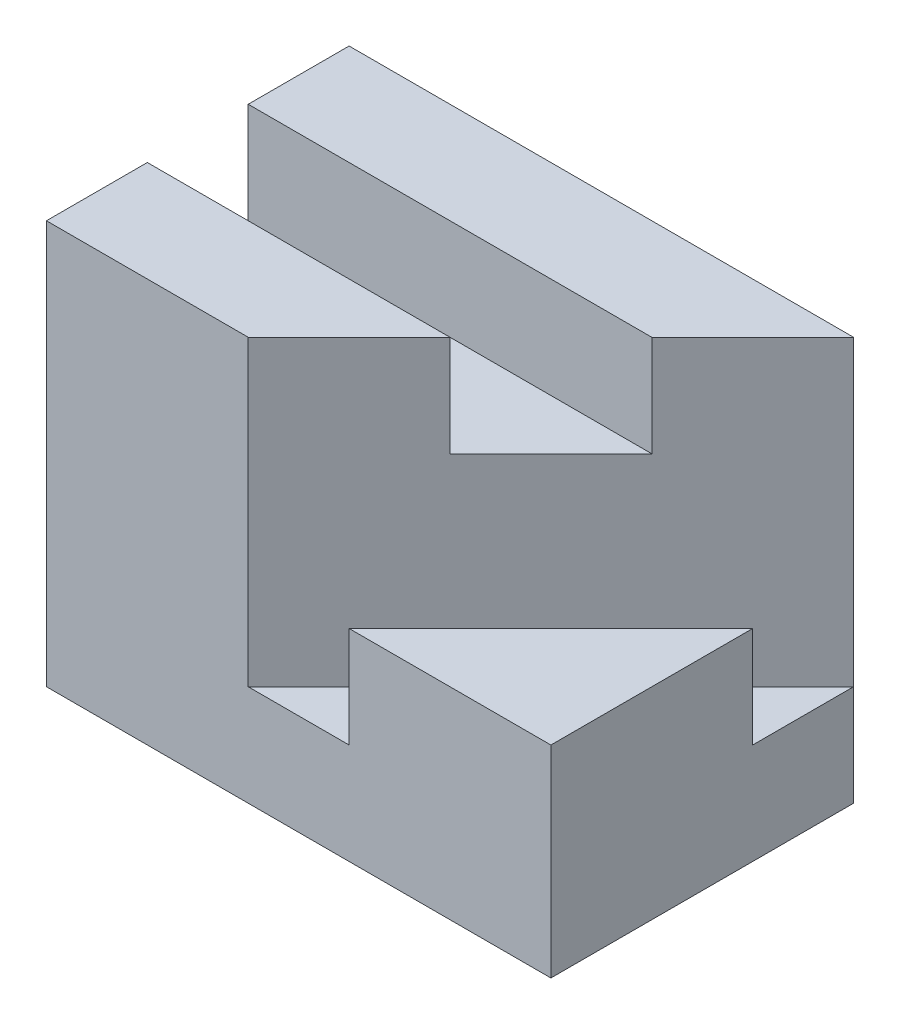
ISO-10303-21;
HEADER;
FILE_DESCRIPTION(('STEP AP214'),'2;1');
FILE_NAME('part.step','',(''),(''),'','','');
FILE_SCHEMA(('AUTOMOTIVE_DESIGN { 1 0 10303 214 1 1 1 1 }'));
ENDSEC;
DATA;
#1=APPLICATION_CONTEXT('core data for automotive mechanical design processes');
#2=APPLICATION_PROTOCOL_DEFINITION('international standard','automotive_design',2000,#1);
#3=PRODUCT_CONTEXT('',#1,'mechanical');
#4=PRODUCT('Part','Part','',(#3));
#5=PRODUCT_RELATED_PRODUCT_CATEGORY('part','',(#4));
#6=PRODUCT_DEFINITION_FORMATION('','',#4);
#7=PRODUCT_DEFINITION_CONTEXT('part definition',#1,'design');
#8=PRODUCT_DEFINITION('design','',#6,#7);
#9=PRODUCT_DEFINITION_SHAPE('','',#8);
#10=(LENGTH_UNIT() NAMED_UNIT(*) SI_UNIT(.MILLI.,.METRE.));
#11=(NAMED_UNIT(*) PLANE_ANGLE_UNIT() SI_UNIT($,.RADIAN.));
#12=(NAMED_UNIT(*) SI_UNIT($,.STERADIAN.) SOLID_ANGLE_UNIT());
#13=UNCERTAINTY_MEASURE_WITH_UNIT(LENGTH_MEASURE(1.E-05),#10,'distance_accuracy_value','');
#14=(GEOMETRIC_REPRESENTATION_CONTEXT(3) GLOBAL_UNCERTAINTY_ASSIGNED_CONTEXT((#13)) GLOBAL_UNIT_ASSIGNED_CONTEXT((#10,
#11,#12)) REPRESENTATION_CONTEXT('',''));
#15=CARTESIAN_POINT('',(0.,0.,0.));
#16=DIRECTION('',(0.,0.,1.));
#17=DIRECTION('',(1.,0.,0.));
#18=AXIS2_PLACEMENT_3D('',#15,#16,#17);
#19=CARTESIAN_POINT('',(0.,40.,0.));
#20=DIRECTION('',(0.,-1.,0.));
#21=DIRECTION('',(0.,0.,-1.));
#22=AXIS2_PLACEMENT_3D('',#19,#20,#21);
#23=PLANE('',#22);
#24=DIRECTION('',(1.,0.,0.));
#25=VECTOR('',#24,1.);
#26=CARTESIAN_POINT('',(-25.,40.,15.));
#27=LINE('',#26,#25);
#28=CARTESIAN_POINT('',(-25.,40.,15.));
#29=VERTEX_POINT('',#28);
#30=CARTESIAN_POINT('',(-4.99999999999999,40.,15.));
#31=VERTEX_POINT('',#30);
#32=EDGE_CURVE('E86',#29,#31,#27,.T.);
#33=ORIENTED_EDGE('',*,*,#32,.T.);
#34=DIRECTION('',(-0.707106781186547,0.,0.707106781186547));
#35=VECTOR('',#34,1.);
#36=CARTESIAN_POINT('',(25.,40.,-15.));
#37=LINE('',#36,#35);
#38=CARTESIAN_POINT('',(5.00000000000001,40.,5.));
#39=VERTEX_POINT('',#38);
#40=EDGE_CURVE('E182',#39,#31,#37,.T.);
#41=ORIENTED_EDGE('',*,*,#40,.F.);
#42=DIRECTION('',(1.,0.,0.));
#43=VECTOR('',#42,1.);
#44=CARTESIAN_POINT('',(-25.,40.,5.));
#45=LINE('',#44,#43);
#46=CARTESIAN_POINT('',(-25.,40.,5.));
#47=VERTEX_POINT('',#46);
#48=EDGE_CURVE('E98',#47,#39,#45,.T.);
#49=ORIENTED_EDGE('',*,*,#48,.F.);
#50=DIRECTION('',(0.,0.,1.));
#51=VECTOR('',#50,1.);
#52=CARTESIAN_POINT('',(-25.,40.,15.));
#53=LINE('',#52,#51);
#54=EDGE_CURVE('E49',#47,#29,#53,.T.);
#55=ORIENTED_EDGE('',*,*,#54,.T.);
#56=EDGE_LOOP('',(#33,#41,#49,#55));
#57=FACE_BOUND('',#56,.T.);
#58=ADVANCED_FACE('F32',(#57),#23,.F.);
#59=CARTESIAN_POINT('',(25.,40.,15.));
#60=DIRECTION('',(-1.,0.,0.));
#61=DIRECTION('',(0.,0.,1.));
#62=AXIS2_PLACEMENT_3D('',#59,#60,#61);
#63=PLANE('',#62);
#64=DIRECTION('',(0.,0.,-1.));
#65=VECTOR('',#64,1.);
#66=CARTESIAN_POINT('',(25.,10.,-15.));
#67=LINE('',#66,#65);
#68=CARTESIAN_POINT('',(25.,10.,-5.));
#69=VERTEX_POINT('',#68);
#70=CARTESIAN_POINT('',(25.,10.,-15.));
#71=VERTEX_POINT('',#70);
#72=EDGE_CURVE('E120',#69,#71,#67,.T.);
#73=ORIENTED_EDGE('',*,*,#72,.F.);
#74=DIRECTION('',(0.,1.,0.));
#75=VECTOR('',#74,1.);
#76=CARTESIAN_POINT('',(25.,10.,-5.));
#77=LINE('',#76,#75);
#78=CARTESIAN_POINT('',(25.,20.,-5.));
#79=VERTEX_POINT('',#78);
#80=EDGE_CURVE('E208',#69,#79,#77,.T.);
#81=ORIENTED_EDGE('',*,*,#80,.T.);
#82=DIRECTION('',(0.,0.,-1.));
#83=VECTOR('',#82,1.);
#84=CARTESIAN_POINT('',(25.,20.,15.));
#85=LINE('',#84,#83);
#86=CARTESIAN_POINT('',(25.,20.,15.));
#87=VERTEX_POINT('',#86);
#88=EDGE_CURVE('E82',#87,#79,#85,.T.);
#89=ORIENTED_EDGE('',*,*,#88,.F.);
#90=DIRECTION('',(0.,-1.,0.));
#91=VECTOR('',#90,1.);
#92=CARTESIAN_POINT('',(25.,40.,15.));
#93=LINE('',#92,#91);
#94=CARTESIAN_POINT('',(25.,0.,15.));
#95=VERTEX_POINT('',#94);
#96=EDGE_CURVE('E73',#87,#95,#93,.T.);
#97=ORIENTED_EDGE('',*,*,#96,.T.);
#98=DIRECTION('',(0.,0.,-1.));
#99=VECTOR('',#98,1.);
#100=CARTESIAN_POINT('',(25.,0.,15.));
#101=LINE('',#100,#99);
#102=CARTESIAN_POINT('',(25.,0.,-15.));
#103=VERTEX_POINT('',#102);
#104=EDGE_CURVE('E78',#95,#103,#101,.T.);
#105=ORIENTED_EDGE('',*,*,#104,.T.);
#106=DIRECTION('',(0.,-1.,0.));
#107=VECTOR('',#106,1.);
#108=CARTESIAN_POINT('',(25.,40.,-15.));
#109=LINE('',#108,#107);
#110=EDGE_CURVE('E110',#71,#103,#109,.T.);
#111=ORIENTED_EDGE('',*,*,#110,.F.);
#112=EDGE_LOOP('',(#73,#81,#89,#97,#105,#111));
#113=FACE_BOUND('',#112,.T.);
#114=ADVANCED_FACE('F34',(#113),#63,.F.);
#115=CARTESIAN_POINT('',(-25.,40.,-15.));
#116=DIRECTION('',(0.,0.,1.));
#117=DIRECTION('',(1.,0.,0.));
#118=AXIS2_PLACEMENT_3D('',#115,#116,#117);
#119=PLANE('',#118);
#120=DIRECTION('',(-1.,0.,0.));
#121=VECTOR('',#120,1.);
#122=CARTESIAN_POINT('',(-25.,0.,-15.));
#123=LINE('',#122,#121);
#124=CARTESIAN_POINT('',(-25.,0.,-15.));
#125=VERTEX_POINT('',#124);
#126=EDGE_CURVE('E97',#103,#125,#123,.T.);
#127=ORIENTED_EDGE('',*,*,#126,.T.);
#128=DIRECTION('',(0.,-1.,0.));
#129=VECTOR('',#128,1.);
#130=CARTESIAN_POINT('',(-25.,40.,-15.));
#131=LINE('',#130,#129);
#132=CARTESIAN_POINT('',(-25.,40.,-15.));
#133=VERTEX_POINT('',#132);
#134=EDGE_CURVE('E109',#133,#125,#131,.T.);
#135=ORIENTED_EDGE('',*,*,#134,.F.);
#136=DIRECTION('',(-1.,0.,0.));
#137=VECTOR('',#136,1.);
#138=CARTESIAN_POINT('',(-25.,40.,-15.));
#139=LINE('',#138,#137);
#140=CARTESIAN_POINT('',(25.,40.,-15.));
#141=VERTEX_POINT('',#140);
#142=EDGE_CURVE('E93',#141,#133,#139,.T.);
#143=ORIENTED_EDGE('',*,*,#142,.F.);
#144=EDGE_CURVE('E41',#141,#71,#109,.T.);
#145=ORIENTED_EDGE('',*,*,#144,.T.);
#146=ORIENTED_EDGE('',*,*,#110,.T.);
#147=EDGE_LOOP('',(#127,#135,#143,#145,#146));
#148=FACE_BOUND('',#147,.T.);
#149=ADVANCED_FACE('F116',(#148),#119,.F.);
#150=CARTESIAN_POINT('',(-25.,40.,15.));
#151=DIRECTION('',(1.,0.,0.));
#152=DIRECTION('',(0.,0.,-1.));
#153=AXIS2_PLACEMENT_3D('',#150,#151,#152);
#154=PLANE('',#153);
#155=ORIENTED_EDGE('',*,*,#54,.F.);
#156=DIRECTION('',(0.,-1.,0.));
#157=VECTOR('',#156,1.);
#158=CARTESIAN_POINT('',(-25.,40.,5.));
#159=LINE('',#158,#157);
#160=CARTESIAN_POINT('',(-25.,30.,5.));
#161=VERTEX_POINT('',#160);
#162=EDGE_CURVE('E171',#47,#161,#159,.T.);
#163=ORIENTED_EDGE('',*,*,#162,.T.);
#164=DIRECTION('',(0.,0.,-1.));
#165=VECTOR('',#164,1.);
#166=CARTESIAN_POINT('',(-25.,30.,5.));
#167=LINE('',#166,#165);
#168=CARTESIAN_POINT('',(-25.,30.,-5.));
#169=VERTEX_POINT('',#168);
#170=EDGE_CURVE('E178',#161,#169,#167,.T.);
#171=ORIENTED_EDGE('',*,*,#170,.T.);
#172=DIRECTION('',(0.,1.,0.));
#173=VECTOR('',#172,1.);
#174=CARTESIAN_POINT('',(-25.,40.,-5.));
#175=LINE('',#174,#173);
#176=CARTESIAN_POINT('',(-25.,40.,-5.));
#177=VERTEX_POINT('',#176);
#178=EDGE_CURVE('E190',#169,#177,#175,.T.);
#179=ORIENTED_EDGE('',*,*,#178,.T.);
#180=EDGE_CURVE('E184',#133,#177,#53,.T.);
#181=ORIENTED_EDGE('',*,*,#180,.F.);
#182=ORIENTED_EDGE('',*,*,#134,.T.);
#183=DIRECTION('',(0.,0.,1.));
#184=VECTOR('',#183,1.);
#185=CARTESIAN_POINT('',(-25.,0.,15.));
#186=LINE('',#185,#184);
#187=CARTESIAN_POINT('',(-25.,0.,15.));
#188=VERTEX_POINT('',#187);
#189=EDGE_CURVE('E66',#125,#188,#186,.T.);
#190=ORIENTED_EDGE('',*,*,#189,.T.);
#191=DIRECTION('',(0.,-1.,0.));
#192=VECTOR('',#191,1.);
#193=CARTESIAN_POINT('',(-25.,40.,15.));
#194=LINE('',#193,#192);
#195=EDGE_CURVE('E85',#29,#188,#194,.T.);
#196=ORIENTED_EDGE('',*,*,#195,.F.);
#197=EDGE_LOOP('',(#155,#163,#171,#179,#181,#182,#190,#196));
#198=FACE_BOUND('',#197,.T.);
#199=ADVANCED_FACE('F183',(#198),#154,.F.);
#200=CARTESIAN_POINT('',(-25.,40.,15.));
#201=DIRECTION('',(0.,0.,-1.));
#202=DIRECTION('',(-1.,0.,0.));
#203=AXIS2_PLACEMENT_3D('',#200,#201,#202);
#204=PLANE('',#203);
#205=DIRECTION('',(1.,0.,0.));
#206=VECTOR('',#205,1.);
#207=CARTESIAN_POINT('',(5.00000000000001,20.,15.));
#208=LINE('',#207,#206);
#209=CARTESIAN_POINT('',(5.00000000000001,20.,15.));
#210=VERTEX_POINT('',#209);
#211=EDGE_CURVE('E201',#210,#87,#208,.T.);
#212=ORIENTED_EDGE('',*,*,#211,.F.);
#213=DIRECTION('',(0.,1.,0.));
#214=VECTOR('',#213,1.);
#215=CARTESIAN_POINT('',(5.00000000000001,10.,15.));
#216=LINE('',#215,#214);
#217=CARTESIAN_POINT('',(5.00000000000001,10.,15.));
#218=VERTEX_POINT('',#217);
#219=EDGE_CURVE('E212',#218,#210,#216,.T.);
#220=ORIENTED_EDGE('',*,*,#219,.F.);
#221=DIRECTION('',(1.,0.,0.));
#222=VECTOR('',#221,1.);
#223=CARTESIAN_POINT('',(5.00000000000001,10.,15.));
#224=LINE('',#223,#222);
#225=CARTESIAN_POINT('',(-4.99999999999999,10.,15.));
#226=VERTEX_POINT('',#225);
#227=EDGE_CURVE('E220',#226,#218,#224,.T.);
#228=ORIENTED_EDGE('',*,*,#227,.F.);
#229=DIRECTION('',(0.,1.,0.));
#230=VECTOR('',#229,1.);
#231=CARTESIAN_POINT('',(-4.99999999999999,10.,15.));
#232=LINE('',#231,#230);
#233=EDGE_CURVE('E209',#226,#31,#232,.T.);
#234=ORIENTED_EDGE('',*,*,#233,.T.);
#235=ORIENTED_EDGE('',*,*,#32,.F.);
#236=ORIENTED_EDGE('',*,*,#195,.T.);
#237=DIRECTION('',(1.,0.,0.));
#238=VECTOR('',#237,1.);
#239=CARTESIAN_POINT('',(-25.,0.,15.));
#240=LINE('',#239,#238);
#241=EDGE_CURVE('E89',#188,#95,#240,.T.);
#242=ORIENTED_EDGE('',*,*,#241,.T.);
#243=ORIENTED_EDGE('',*,*,#96,.F.);
#244=EDGE_LOOP('',(#212,#220,#228,#234,#235,#236,#242,#243));
#245=FACE_BOUND('',#244,.T.);
#246=ADVANCED_FACE('F90',(#245),#204,.F.);
#247=DIRECTION('',(1.,0.,0.));
#248=VECTOR('',#247,1.);
#249=CARTESIAN_POINT('',(-25.,40.,-5.));
#250=LINE('',#249,#248);
#251=CARTESIAN_POINT('',(15.,40.,-5.));
#252=VERTEX_POINT('',#251);
#253=EDGE_CURVE('E102',#177,#252,#250,.T.);
#254=ORIENTED_EDGE('',*,*,#253,.T.);
#255=EDGE_CURVE('E216',#141,#252,#37,.T.);
#256=ORIENTED_EDGE('',*,*,#255,.F.);
#257=ORIENTED_EDGE('',*,*,#142,.T.);
#258=ORIENTED_EDGE('',*,*,#180,.T.);
#259=EDGE_LOOP('',(#254,#256,#257,#258));
#260=FACE_BOUND('',#259,.T.);
#261=ADVANCED_FACE('F247',(#260),#23,.F.);
#262=CARTESIAN_POINT('',(0.,0.,0.));
#263=DIRECTION('',(0.,-1.,0.));
#264=DIRECTION('',(0.,0.,-1.));
#265=AXIS2_PLACEMENT_3D('',#262,#263,#264);
#266=PLANE('',#265);
#267=ORIENTED_EDGE('',*,*,#104,.F.);
#268=ORIENTED_EDGE('',*,*,#241,.F.);
#269=ORIENTED_EDGE('',*,*,#189,.F.);
#270=ORIENTED_EDGE('',*,*,#126,.F.);
#271=EDGE_LOOP('',(#267,#268,#269,#270));
#272=FACE_BOUND('',#271,.T.);
#273=ADVANCED_FACE('F96',(#272),#266,.T.);
#274=CARTESIAN_POINT('',(-25.,40.,5.));
#275=DIRECTION('',(0.,0.,1.));
#276=DIRECTION('',(0.,-1.,0.));
#277=AXIS2_PLACEMENT_3D('',#274,#275,#276);
#278=PLANE('',#277);
#279=ORIENTED_EDGE('',*,*,#48,.T.);
#280=DIRECTION('',(0.,-1.,0.));
#281=VECTOR('',#280,1.);
#282=CARTESIAN_POINT('',(5.00000000000001,40.,5.));
#283=LINE('',#282,#281);
#284=CARTESIAN_POINT('',(5.00000000000001,30.,5.));
#285=VERTEX_POINT('',#284);
#286=EDGE_CURVE('E203',#39,#285,#283,.T.);
#287=ORIENTED_EDGE('',*,*,#286,.T.);
#288=DIRECTION('',(1.,0.,0.));
#289=VECTOR('',#288,1.);
#290=CARTESIAN_POINT('',(-25.,30.,5.));
#291=LINE('',#290,#289);
#292=EDGE_CURVE('E175',#161,#285,#291,.T.);
#293=ORIENTED_EDGE('',*,*,#292,.F.);
#294=ORIENTED_EDGE('',*,*,#162,.F.);
#295=EDGE_LOOP('',(#279,#287,#293,#294));
#296=FACE_BOUND('',#295,.T.);
#297=ADVANCED_FACE('F172',(#296),#278,.F.);
#298=CARTESIAN_POINT('',(-25.,40.,-5.));
#299=DIRECTION('',(0.,0.,-1.));
#300=DIRECTION('',(-1.,0.,0.));
#301=AXIS2_PLACEMENT_3D('',#298,#299,#300);
#302=PLANE('',#301);
#303=DIRECTION('',(1.,0.,0.));
#304=VECTOR('',#303,1.);
#305=CARTESIAN_POINT('',(-25.,30.,-5.));
#306=LINE('',#305,#304);
#307=CARTESIAN_POINT('',(15.,30.,-5.));
#308=VERTEX_POINT('',#307);
#309=EDGE_CURVE('E189',#169,#308,#306,.T.);
#310=ORIENTED_EDGE('',*,*,#309,.T.);
#311=DIRECTION('',(0.,1.,0.));
#312=VECTOR('',#311,1.);
#313=CARTESIAN_POINT('',(15.,40.,-5.));
#314=LINE('',#313,#312);
#315=EDGE_CURVE('E205',#308,#252,#314,.T.);
#316=ORIENTED_EDGE('',*,*,#315,.T.);
#317=ORIENTED_EDGE('',*,*,#253,.F.);
#318=ORIENTED_EDGE('',*,*,#178,.F.);
#319=EDGE_LOOP('',(#310,#316,#317,#318));
#320=FACE_BOUND('',#319,.T.);
#321=ADVANCED_FACE('F241',(#320),#302,.F.);
#322=CARTESIAN_POINT('',(-25.,30.,5.));
#323=DIRECTION('',(0.,-1.,0.));
#324=DIRECTION('',(0.,0.,-1.));
#325=AXIS2_PLACEMENT_3D('',#322,#323,#324);
#326=PLANE('',#325);
#327=ORIENTED_EDGE('',*,*,#292,.T.);
#328=DIRECTION('',(0.707106781186548,0.,-0.707106781186548));
#329=VECTOR('',#328,1.);
#330=CARTESIAN_POINT('',(-9.99999999999999,30.,20.));
#331=LINE('',#330,#329);
#332=EDGE_CURVE('E11',#285,#308,#331,.T.);
#333=ORIENTED_EDGE('',*,*,#332,.T.);
#334=ORIENTED_EDGE('',*,*,#309,.F.);
#335=ORIENTED_EDGE('',*,*,#170,.F.);
#336=EDGE_LOOP('',(#327,#333,#334,#335));
#337=FACE_BOUND('',#336,.T.);
#338=ADVANCED_FACE('F234',(#337),#326,.F.);
#339=CARTESIAN_POINT('',(0.,20.,0.));
#340=DIRECTION('',(0.,1.,0.));
#341=DIRECTION('',(0.,0.,1.));
#342=AXIS2_PLACEMENT_3D('',#339,#340,#341);
#343=PLANE('',#342);
#344=ORIENTED_EDGE('',*,*,#211,.T.);
#345=ORIENTED_EDGE('',*,*,#88,.T.);
#346=DIRECTION('',(-0.707106781186548,0.,0.707106781186547));
#347=VECTOR('',#346,1.);
#348=CARTESIAN_POINT('',(25.,20.,-5.));
#349=LINE('',#348,#347);
#350=EDGE_CURVE('E179',#79,#210,#349,.T.);
#351=ORIENTED_EDGE('',*,*,#350,.T.);
#352=EDGE_LOOP('',(#344,#345,#351));
#353=FACE_BOUND('',#352,.T.);
#354=ADVANCED_FACE('F231',(#353),#343,.T.);
#355=CARTESIAN_POINT('',(25.,10.,-15.));
#356=DIRECTION('',(-0.707106781186547,0.,-0.707106781186547));
#357=DIRECTION('',(-0.707106781186548,0.,0.707106781186548));
#358=AXIS2_PLACEMENT_3D('',#355,#356,#357);
#359=PLANE('',#358);
#360=ORIENTED_EDGE('',*,*,#40,.T.);
#361=ORIENTED_EDGE('',*,*,#233,.F.);
#362=DIRECTION('',(-0.707106781186547,0.,0.707106781186547));
#363=VECTOR('',#362,1.);
#364=CARTESIAN_POINT('',(25.,10.,-15.));
#365=LINE('',#364,#363);
#366=EDGE_CURVE('E128',#71,#226,#365,.T.);
#367=ORIENTED_EDGE('',*,*,#366,.F.);
#368=ORIENTED_EDGE('',*,*,#144,.F.);
#369=ORIENTED_EDGE('',*,*,#255,.T.);
#370=ORIENTED_EDGE('',*,*,#315,.F.);
#371=ORIENTED_EDGE('',*,*,#332,.F.);
#372=ORIENTED_EDGE('',*,*,#286,.F.);
#373=EDGE_LOOP('',(#360,#361,#367,#368,#369,#370,#371,#372));
#374=FACE_BOUND('',#373,.T.);
#375=ADVANCED_FACE('F233',(#374),#359,.F.);
#376=CARTESIAN_POINT('',(25.,10.,-5.));
#377=DIRECTION('',(0.707106781186547,0.,0.707106781186548));
#378=DIRECTION('',(0.707106781186548,0.,-0.707106781186547));
#379=AXIS2_PLACEMENT_3D('',#376,#377,#378);
#380=PLANE('',#379);
#381=ORIENTED_EDGE('',*,*,#350,.F.);
#382=ORIENTED_EDGE('',*,*,#80,.F.);
#383=DIRECTION('',(0.707106781186548,0.,-0.707106781186547));
#384=VECTOR('',#383,1.);
#385=CARTESIAN_POINT('',(25.,10.,-5.));
#386=LINE('',#385,#384);
#387=EDGE_CURVE('E213',#218,#69,#386,.T.);
#388=ORIENTED_EDGE('',*,*,#387,.F.);
#389=ORIENTED_EDGE('',*,*,#219,.T.);
#390=EDGE_LOOP('',(#381,#382,#388,#389));
#391=FACE_BOUND('',#390,.T.);
#392=ADVANCED_FACE('F229',(#391),#380,.F.);
#393=CARTESIAN_POINT('',(0.,10.,0.));
#394=DIRECTION('',(0.,-1.,0.));
#395=DIRECTION('',(0.,0.,-1.));
#396=AXIS2_PLACEMENT_3D('',#393,#394,#395);
#397=PLANE('',#396);
#398=ORIENTED_EDGE('',*,*,#72,.T.);
#399=ORIENTED_EDGE('',*,*,#366,.T.);
#400=ORIENTED_EDGE('',*,*,#227,.T.);
#401=ORIENTED_EDGE('',*,*,#387,.T.);
#402=EDGE_LOOP('',(#398,#399,#400,#401));
#403=FACE_BOUND('',#402,.T.);
#404=ADVANCED_FACE('F224',(#403),#397,.F.);
#405=CLOSED_SHELL('',(#58,#114,#149,#199,#246,#261,#273,#297,#321,#338,#354,#375,#392,#404));
#406=MANIFOLD_SOLID_BREP('B2',#405);
#407=ADVANCED_BREP_SHAPE_REPRESENTATION('',(#18,#406),#14);
#408=SHAPE_DEFINITION_REPRESENTATION(#9,#407);
ENDSEC;
END-ISO-10303-21;
